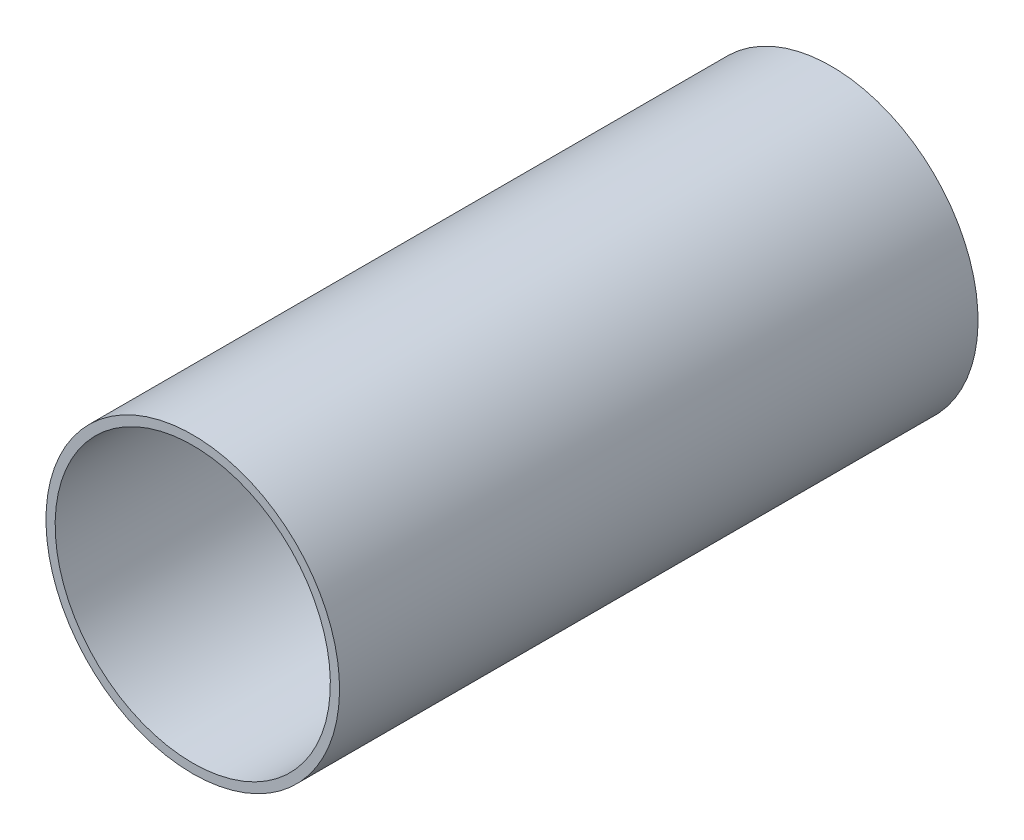
ISO-10303-21;
HEADER;
FILE_DESCRIPTION(('STEP AP214'),'2;1');
FILE_NAME('part.step','',(''),(''),'','','');
FILE_SCHEMA(('AUTOMOTIVE_DESIGN { 1 0 10303 214 1 1 1 1 }'));
ENDSEC;
DATA;
#1=APPLICATION_CONTEXT('core data for automotive mechanical design processes');
#2=APPLICATION_PROTOCOL_DEFINITION('international standard','automotive_design',2000,#1);
#3=PRODUCT_CONTEXT('',#1,'mechanical');
#4=PRODUCT('Part','Part','',(#3));
#5=PRODUCT_RELATED_PRODUCT_CATEGORY('part','',(#4));
#6=PRODUCT_DEFINITION_FORMATION('','',#4);
#7=PRODUCT_DEFINITION_CONTEXT('part definition',#1,'design');
#8=PRODUCT_DEFINITION('design','',#6,#7);
#9=PRODUCT_DEFINITION_SHAPE('','',#8);
#10=(LENGTH_UNIT() NAMED_UNIT(*) SI_UNIT(.MILLI.,.METRE.));
#11=(NAMED_UNIT(*) PLANE_ANGLE_UNIT() SI_UNIT($,.RADIAN.));
#12=(NAMED_UNIT(*) SI_UNIT($,.STERADIAN.) SOLID_ANGLE_UNIT());
#13=UNCERTAINTY_MEASURE_WITH_UNIT(LENGTH_MEASURE(1.E-05),#10,'distance_accuracy_value','');
#14=(GEOMETRIC_REPRESENTATION_CONTEXT(3) GLOBAL_UNCERTAINTY_ASSIGNED_CONTEXT((#13)) GLOBAL_UNIT_ASSIGNED_CONTEXT((#10,
#11,#12)) REPRESENTATION_CONTEXT('',''));
#15=CARTESIAN_POINT('',(0.,0.,0.));
#16=DIRECTION('',(0.,0.,1.));
#17=DIRECTION('',(1.,0.,0.));
#18=AXIS2_PLACEMENT_3D('',#15,#16,#17);
#19=CARTESIAN_POINT('',(152.4,-80.772,-0.045));
#20=DIRECTION('',(0.,0.,-1.));
#21=DIRECTION('',(0.,-1.,0.));
#22=AXIS2_PLACEMENT_3D('',#19,#20,#21);
#23=CYLINDRICAL_SURFACE('',#22,0.375);
#24=CARTESIAN_POINT('',(152.4,-80.772,-0.035));
#25=DIRECTION('',(0.,0.,-1.));
#26=DIRECTION('',(0.,-1.,0.));
#27=AXIS2_PLACEMENT_3D('',#24,#25,#26);
#28=CIRCLE('',#27,0.375);
#29=CARTESIAN_POINT('',(152.4,-81.147,-0.035));
#30=VERTEX_POINT('',#29);
#31=EDGE_CURVE('E63',#30,#30,#28,.T.);
#32=ORIENTED_EDGE('',*,*,#31,.T.);
#33=DIRECTION('',(0.,0.,1.));
#34=VECTOR('',#33,1.);
#35=CARTESIAN_POINT('',(152.4,-81.147,-0.045));
#36=LINE('',#35,#34);
#37=CARTESIAN_POINT('',(152.4,-81.147,1.705));
#38=VERTEX_POINT('',#37);
#39=EDGE_CURVE('E11',#30,#38,#36,.T.);
#40=ORIENTED_EDGE('',*,*,#39,.T.);
#41=CARTESIAN_POINT('',(152.4,-80.772,1.705));
#42=DIRECTION('',(0.,0.,-1.));
#43=DIRECTION('',(0.,-1.,0.));
#44=AXIS2_PLACEMENT_3D('',#41,#42,#43);
#45=CIRCLE('',#44,0.375);
#46=EDGE_CURVE('E25',#38,#38,#45,.T.);
#47=ORIENTED_EDGE('',*,*,#46,.F.);
#48=ORIENTED_EDGE('',*,*,#39,.F.);
#49=EDGE_LOOP('',(#32,#40,#47,#48));
#50=FACE_BOUND('',#49,.T.);
#51=ADVANCED_FACE('F17',(#50),#23,.F.);
#52=CARTESIAN_POINT('',(152.4,-81.172,1.705));
#53=DIRECTION('',(0.,0.,1.));
#54=DIRECTION('',(1.,0.,0.));
#55=AXIS2_PLACEMENT_3D('',#52,#53,#54);
#56=PLANE('',#55);
#57=ORIENTED_EDGE('',*,*,#46,.T.);
#58=EDGE_LOOP('',(#57));
#59=FACE_BOUND('',#58,.T.);
#60=CARTESIAN_POINT('',(152.4,-80.772,1.705));
#61=DIRECTION('',(0.,0.,1.));
#62=DIRECTION('',(0.,-1.,0.));
#63=AXIS2_PLACEMENT_3D('',#60,#61,#62);
#64=CIRCLE('',#63,0.4);
#65=CARTESIAN_POINT('',(152.4,-81.172,1.705));
#66=VERTEX_POINT('',#65);
#67=EDGE_CURVE('E55',#66,#66,#64,.T.);
#68=ORIENTED_EDGE('',*,*,#67,.T.);
#69=EDGE_LOOP('',(#68));
#70=FACE_BOUND('',#69,.T.);
#71=ADVANCED_FACE('F79',(#59,#70),#56,.T.);
#72=CARTESIAN_POINT('',(152.4,-81.172,-0.035));
#73=DIRECTION('',(0.,0.,1.));
#74=DIRECTION('',(1.,0.,0.));
#75=AXIS2_PLACEMENT_3D('',#72,#73,#74);
#76=PLANE('',#75);
#77=ORIENTED_EDGE('',*,*,#31,.F.);
#78=EDGE_LOOP('',(#77));
#79=FACE_BOUND('',#78,.T.);
#80=CARTESIAN_POINT('',(152.4,-80.772,-0.035));
#81=DIRECTION('',(0.,0.,1.));
#82=DIRECTION('',(0.,-1.,0.));
#83=AXIS2_PLACEMENT_3D('',#80,#81,#82);
#84=CIRCLE('',#83,0.4);
#85=CARTESIAN_POINT('',(152.4,-81.172,-0.035));
#86=VERTEX_POINT('',#85);
#87=EDGE_CURVE('E54',#86,#86,#84,.T.);
#88=ORIENTED_EDGE('',*,*,#87,.F.);
#89=EDGE_LOOP('',(#88));
#90=FACE_BOUND('',#89,.T.);
#91=ADVANCED_FACE('F76',(#79,#90),#76,.F.);
#92=CARTESIAN_POINT('',(152.4,-80.772,-0.035));
#93=DIRECTION('',(0.,0.,-1.));
#94=DIRECTION('',(0.,-1.,0.));
#95=AXIS2_PLACEMENT_3D('',#92,#93,#94);
#96=CYLINDRICAL_SURFACE('',#95,0.4);
#97=ORIENTED_EDGE('',*,*,#87,.T.);
#98=DIRECTION('',(0.,0.,1.));
#99=VECTOR('',#98,1.);
#100=CARTESIAN_POINT('',(152.4,-81.172,-0.035));
#101=LINE('',#100,#99);
#102=EDGE_CURVE('E51',#86,#66,#101,.T.);
#103=ORIENTED_EDGE('',*,*,#102,.T.);
#104=ORIENTED_EDGE('',*,*,#67,.F.);
#105=ORIENTED_EDGE('',*,*,#102,.F.);
#106=EDGE_LOOP('',(#97,#103,#104,#105));
#107=FACE_BOUND('',#106,.T.);
#108=ADVANCED_FACE('F52',(#107),#96,.T.);
#109=CLOSED_SHELL('',(#51,#71,#91,#108));
#110=MANIFOLD_SOLID_BREP('B1',#109);
#111=ADVANCED_BREP_SHAPE_REPRESENTATION('',(#18,#110),#14);
#112=SHAPE_DEFINITION_REPRESENTATION(#9,#111);
ENDSEC;
END-ISO-10303-21;
